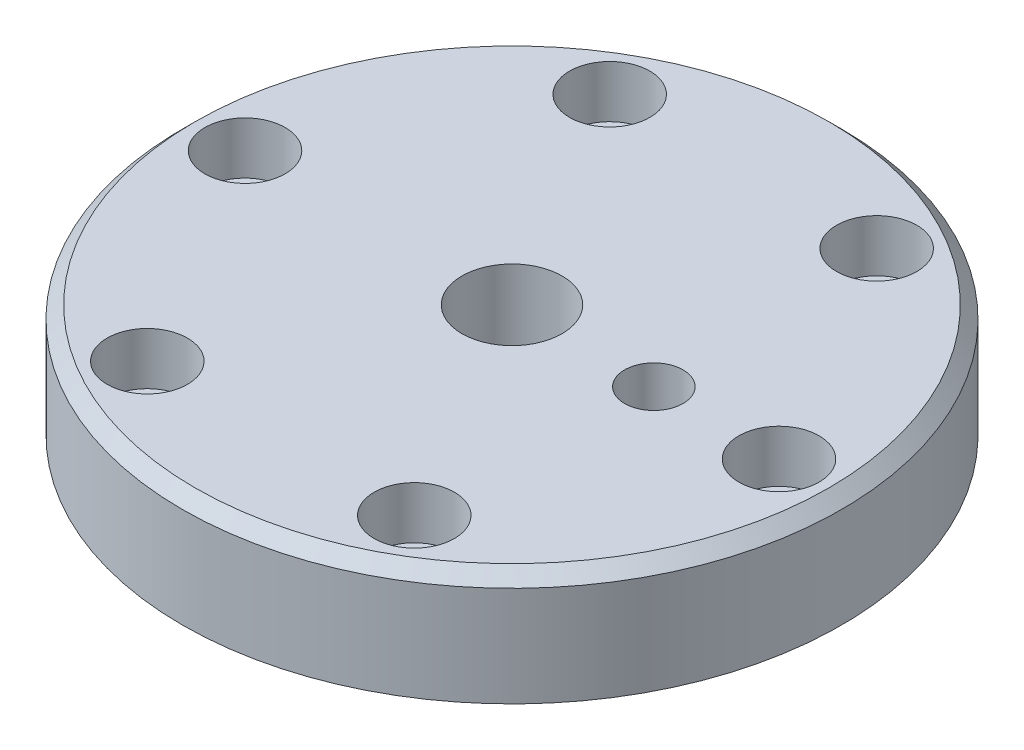
ISO-10303-21;
HEADER;
FILE_DESCRIPTION(('STEP AP214'),'2;1');
FILE_NAME('part.step','',(''),(''),'','','');
FILE_SCHEMA(('AUTOMOTIVE_DESIGN { 1 0 10303 214 1 1 1 1 }'));
ENDSEC;
DATA;
#1=APPLICATION_CONTEXT('core data for automotive mechanical design processes');
#2=APPLICATION_PROTOCOL_DEFINITION('international standard','automotive_design',2000,#1);
#3=PRODUCT_CONTEXT('',#1,'mechanical');
#4=PRODUCT('Part','Part','',(#3));
#5=PRODUCT_RELATED_PRODUCT_CATEGORY('part','',(#4));
#6=PRODUCT_DEFINITION_FORMATION('','',#4);
#7=PRODUCT_DEFINITION_CONTEXT('part definition',#1,'design');
#8=PRODUCT_DEFINITION('design','',#6,#7);
#9=PRODUCT_DEFINITION_SHAPE('','',#8);
#10=(LENGTH_UNIT() NAMED_UNIT(*) SI_UNIT(.MILLI.,.METRE.));
#11=(NAMED_UNIT(*) PLANE_ANGLE_UNIT() SI_UNIT($,.RADIAN.));
#12=(NAMED_UNIT(*) SI_UNIT($,.STERADIAN.) SOLID_ANGLE_UNIT());
#13=UNCERTAINTY_MEASURE_WITH_UNIT(LENGTH_MEASURE(1.E-05),#10,'distance_accuracy_value','');
#14=(GEOMETRIC_REPRESENTATION_CONTEXT(3) GLOBAL_UNCERTAINTY_ASSIGNED_CONTEXT((#13)) GLOBAL_UNIT_ASSIGNED_CONTEXT((#10,
#11,#12)) REPRESENTATION_CONTEXT('',''));
#15=CARTESIAN_POINT('',(0.,0.,0.));
#16=DIRECTION('',(0.,0.,1.));
#17=DIRECTION('',(1.,0.,0.));
#18=AXIS2_PLACEMENT_3D('',#15,#16,#17);
#19=CARTESIAN_POINT('',(0.,0.,0.));
#20=DIRECTION('',(0.,1.,0.));
#21=DIRECTION('',(0.,0.,1.));
#22=AXIS2_PLACEMENT_3D('',#19,#20,#21);
#23=PLANE('',#22);
#24=CARTESIAN_POINT('',(0.,0.,0.));
#25=DIRECTION('',(0.,1.,0.));
#26=DIRECTION('',(0.,0.,1.));
#27=AXIS2_PLACEMENT_3D('',#24,#25,#26);
#28=CIRCLE('',#27,12.);
#29=CARTESIAN_POINT('',(0.,0.,12.));
#30=VERTEX_POINT('',#29);
#31=EDGE_CURVE('E165',#30,#30,#28,.T.);
#32=ORIENTED_EDGE('',*,*,#31,.T.);
#33=EDGE_LOOP('',(#32));
#34=FACE_BOUND('',#33,.T.);
#35=CARTESIAN_POINT('',(0.,0.,0.));
#36=DIRECTION('',(0.,1.,0.));
#37=DIRECTION('',(0.,0.,1.));
#38=AXIS2_PLACEMENT_3D('',#35,#36,#37);
#39=CIRCLE('',#38,22.);
#40=CARTESIAN_POINT('',(0.,0.,22.));
#41=VERTEX_POINT('',#40);
#42=EDGE_CURVE('E333',#41,#41,#39,.T.);
#43=ORIENTED_EDGE('',*,*,#42,.F.);
#44=EDGE_LOOP('',(#43));
#45=FACE_BOUND('',#44,.T.);
#46=ADVANCED_FACE('F39',(#34,#45),#23,.F.);
#47=CARTESIAN_POINT('',(0.,27.,0.));
#48=DIRECTION('',(0.,1.,0.));
#49=DIRECTION('',(0.,0.,1.));
#50=AXIS2_PLACEMENT_3D('',#47,#48,#49);
#51=PLANE('',#50);
#52=CARTESIAN_POINT('',(0.,27.,0.));
#53=DIRECTION('',(0.,1.,0.));
#54=DIRECTION('',(0.,0.,1.));
#55=AXIS2_PLACEMENT_3D('',#52,#53,#54);
#56=CIRCLE('',#55,76.);
#57=CARTESIAN_POINT('',(0.,27.,76.));
#58=VERTEX_POINT('',#57);
#59=EDGE_CURVE('E47',#58,#58,#56,.T.);
#60=ORIENTED_EDGE('',*,*,#59,.T.);
#61=EDGE_LOOP('',(#60));
#62=FACE_BOUND('',#61,.T.);
#63=CARTESIAN_POINT('',(34.,27.,0.));
#64=DIRECTION('',(0.,1.,0.));
#65=DIRECTION('',(0.,0.,1.));
#66=AXIS2_PLACEMENT_3D('',#63,#64,#65);
#67=CIRCLE('',#66,6.99999999999999);
#68=CARTESIAN_POINT('',(34.,27.,6.99999999999999));
#69=VERTEX_POINT('',#68);
#70=EDGE_CURVE('E62',#69,#69,#67,.T.);
#71=ORIENTED_EDGE('',*,*,#70,.F.);
#72=EDGE_LOOP('',(#71));
#73=FACE_BOUND('',#72,.T.);
#74=CARTESIAN_POINT('',(32.,27.,-55.4256258422041));
#75=DIRECTION('',(0.,1.,0.));
#76=DIRECTION('',(0.,0.,1.));
#77=AXIS2_PLACEMENT_3D('',#74,#75,#76);
#78=CIRCLE('',#77,9.625);
#79=CARTESIAN_POINT('',(32.,27.,-45.8006258422041));
#80=VERTEX_POINT('',#79);
#81=EDGE_CURVE('E61',#80,#80,#78,.T.);
#82=ORIENTED_EDGE('',*,*,#81,.F.);
#83=EDGE_LOOP('',(#82));
#84=FACE_BOUND('',#83,.T.);
#85=CARTESIAN_POINT('',(64.0000000000015,27.,-8.71257838218611E-13));
#86=DIRECTION('',(0.,1.,0.));
#87=DIRECTION('',(0.,0.,1.));
#88=AXIS2_PLACEMENT_3D('',#85,#86,#87);
#89=CIRCLE('',#88,9.62499999999999);
#90=CARTESIAN_POINT('',(64.0000000000015,27.,9.62499999999912));
#91=VERTEX_POINT('',#90);
#92=EDGE_CURVE('E85',#91,#91,#89,.T.);
#93=ORIENTED_EDGE('',*,*,#92,.F.);
#94=EDGE_LOOP('',(#93));
#95=FACE_BOUND('',#94,.T.);
#96=CARTESIAN_POINT('',(32.000000000003,27.,55.4256258422041));
#97=DIRECTION('',(0.,1.,0.));
#98=DIRECTION('',(0.,0.,1.));
#99=AXIS2_PLACEMENT_3D('',#96,#97,#98);
#100=CIRCLE('',#99,9.625);
#101=CARTESIAN_POINT('',(32.000000000003,27.,65.0506258422041));
#102=VERTEX_POINT('',#101);
#103=EDGE_CURVE('E101',#102,#102,#100,.T.);
#104=ORIENTED_EDGE('',*,*,#103,.F.);
#105=EDGE_LOOP('',(#104));
#106=FACE_BOUND('',#105,.T.);
#107=CARTESIAN_POINT('',(-31.999999999997,27.,55.4256258422058));
#108=DIRECTION('',(0.,1.,0.));
#109=DIRECTION('',(0.,0.,1.));
#110=AXIS2_PLACEMENT_3D('',#107,#108,#109);
#111=CIRCLE('',#110,9.625);
#112=CARTESIAN_POINT('',(-31.999999999997,27.,65.0506258422058));
#113=VERTEX_POINT('',#112);
#114=EDGE_CURVE('E117',#113,#113,#111,.T.);
#115=ORIENTED_EDGE('',*,*,#114,.F.);
#116=EDGE_LOOP('',(#115));
#117=FACE_BOUND('',#116,.T.);
#118=CARTESIAN_POINT('',(-63.9999999999985,27.,2.62679799590714E-12));
#119=DIRECTION('',(0.,1.,0.));
#120=DIRECTION('',(0.,0.,1.));
#121=AXIS2_PLACEMENT_3D('',#118,#119,#120);
#122=CIRCLE('',#121,9.625);
#123=CARTESIAN_POINT('',(-63.9999999999985,27.,9.62500000000263));
#124=VERTEX_POINT('',#123);
#125=EDGE_CURVE('E133',#124,#124,#122,.T.);
#126=ORIENTED_EDGE('',*,*,#125,.F.);
#127=EDGE_LOOP('',(#126));
#128=FACE_BOUND('',#127,.T.);
#129=CARTESIAN_POINT('',(-32.,27.,-55.4256258422024));
#130=DIRECTION('',(0.,1.,0.));
#131=DIRECTION('',(0.,0.,1.));
#132=AXIS2_PLACEMENT_3D('',#129,#130,#131);
#133=CIRCLE('',#132,9.625);
#134=CARTESIAN_POINT('',(-32.,27.,-45.8006258422024));
#135=VERTEX_POINT('',#134);
#136=EDGE_CURVE('E149',#135,#135,#133,.T.);
#137=ORIENTED_EDGE('',*,*,#136,.F.);
#138=EDGE_LOOP('',(#137));
#139=FACE_BOUND('',#138,.T.);
#140=CARTESIAN_POINT('',(0.,27.,0.));
#141=DIRECTION('',(0.,1.,0.));
#142=DIRECTION('',(0.,0.,1.));
#143=AXIS2_PLACEMENT_3D('',#140,#141,#142);
#144=CIRCLE('',#143,12.);
#145=CARTESIAN_POINT('',(0.,27.,12.));
#146=VERTEX_POINT('',#145);
#147=EDGE_CURVE('E166',#146,#146,#144,.T.);
#148=ORIENTED_EDGE('',*,*,#147,.F.);
#149=EDGE_LOOP('',(#148));
#150=FACE_BOUND('',#149,.T.);
#151=ADVANCED_FACE('F180',(#62,#73,#84,#95,#106,#117,#128,#139,#150),#51,.T.);
#152=CARTESIAN_POINT('',(0.,0.,0.));
#153=DIRECTION('',(0.,1.,0.));
#154=DIRECTION('',(0.,0.,1.));
#155=AXIS2_PLACEMENT_3D('',#152,#153,#154);
#156=CIRCLE('',#155,33.);
#157=CARTESIAN_POINT('',(0.,0.,33.));
#158=VERTEX_POINT('',#157);
#159=EDGE_CURVE('E213',#158,#158,#156,.T.);
#160=ORIENTED_EDGE('',*,*,#159,.T.);
#161=EDGE_LOOP('',(#160));
#162=FACE_BOUND('',#161,.T.);
#163=CARTESIAN_POINT('',(32.,0.,-55.4256258422041));
#164=DIRECTION('',(0.,1.,0.));
#165=DIRECTION('',(0.,0.,1.));
#166=AXIS2_PLACEMENT_3D('',#163,#164,#165);
#167=CIRCLE('',#166,6.24999999999999);
#168=CARTESIAN_POINT('',(32.,0.,-49.1756258422041));
#169=VERTEX_POINT('',#168);
#170=EDGE_CURVE('E81',#169,#169,#167,.T.);
#171=ORIENTED_EDGE('',*,*,#170,.T.);
#172=EDGE_LOOP('',(#171));
#173=FACE_BOUND('',#172,.T.);
#174=CARTESIAN_POINT('',(64.0000000000015,0.,-8.71257838218611E-13));
#175=DIRECTION('',(0.,1.,0.));
#176=DIRECTION('',(0.,0.,1.));
#177=AXIS2_PLACEMENT_3D('',#174,#175,#176);
#178=CIRCLE('',#177,6.24999999999999);
#179=CARTESIAN_POINT('',(64.0000000000015,0.,6.24999999999912));
#180=VERTEX_POINT('',#179);
#181=EDGE_CURVE('E97',#180,#180,#178,.T.);
#182=ORIENTED_EDGE('',*,*,#181,.T.);
#183=EDGE_LOOP('',(#182));
#184=FACE_BOUND('',#183,.T.);
#185=CARTESIAN_POINT('',(32.000000000003,0.,55.4256258422041));
#186=DIRECTION('',(0.,1.,0.));
#187=DIRECTION('',(0.,0.,1.));
#188=AXIS2_PLACEMENT_3D('',#185,#186,#187);
#189=CIRCLE('',#188,6.24999999999999);
#190=CARTESIAN_POINT('',(32.000000000003,0.,61.6756258422041));
#191=VERTEX_POINT('',#190);
#192=EDGE_CURVE('E113',#191,#191,#189,.T.);
#193=ORIENTED_EDGE('',*,*,#192,.T.);
#194=EDGE_LOOP('',(#193));
#195=FACE_BOUND('',#194,.T.);
#196=CARTESIAN_POINT('',(-31.999999999997,0.,55.4256258422058));
#197=DIRECTION('',(0.,1.,0.));
#198=DIRECTION('',(0.,0.,1.));
#199=AXIS2_PLACEMENT_3D('',#196,#197,#198);
#200=CIRCLE('',#199,6.24999999999999);
#201=CARTESIAN_POINT('',(-31.999999999997,0.,61.6756258422058));
#202=VERTEX_POINT('',#201);
#203=EDGE_CURVE('E129',#202,#202,#200,.T.);
#204=ORIENTED_EDGE('',*,*,#203,.T.);
#205=EDGE_LOOP('',(#204));
#206=FACE_BOUND('',#205,.T.);
#207=CARTESIAN_POINT('',(-63.9999999999985,0.,2.62679799590714E-12));
#208=DIRECTION('',(0.,1.,0.));
#209=DIRECTION('',(0.,0.,1.));
#210=AXIS2_PLACEMENT_3D('',#207,#208,#209);
#211=CIRCLE('',#210,6.24999999999999);
#212=CARTESIAN_POINT('',(-63.9999999999985,0.,6.25000000000262));
#213=VERTEX_POINT('',#212);
#214=EDGE_CURVE('E145',#213,#213,#211,.T.);
#215=ORIENTED_EDGE('',*,*,#214,.T.);
#216=EDGE_LOOP('',(#215));
#217=FACE_BOUND('',#216,.T.);
#218=CARTESIAN_POINT('',(-32.,0.,-55.4256258422024));
#219=DIRECTION('',(0.,1.,0.));
#220=DIRECTION('',(0.,0.,1.));
#221=AXIS2_PLACEMENT_3D('',#218,#219,#220);
#222=CIRCLE('',#221,6.24999999999999);
#223=CARTESIAN_POINT('',(-32.,0.,-49.1756258422024));
#224=VERTEX_POINT('',#223);
#225=EDGE_CURVE('E161',#224,#224,#222,.T.);
#226=ORIENTED_EDGE('',*,*,#225,.T.);
#227=EDGE_LOOP('',(#226));
#228=FACE_BOUND('',#227,.T.);
#229=CARTESIAN_POINT('',(0.,0.,0.));
#230=DIRECTION('',(0.,1.,0.));
#231=DIRECTION('',(0.,0.,1.));
#232=AXIS2_PLACEMENT_3D('',#229,#230,#231);
#233=CIRCLE('',#232,79.);
#234=CARTESIAN_POINT('',(0.,0.,79.));
#235=VERTEX_POINT('',#234);
#236=EDGE_CURVE('E170',#235,#235,#233,.T.);
#237=ORIENTED_EDGE('',*,*,#236,.F.);
#238=EDGE_LOOP('',(#237));
#239=FACE_BOUND('',#238,.T.);
#240=ADVANCED_FACE('F196',(#162,#173,#184,#195,#206,#217,#228,#239),#23,.F.);
#241=CARTESIAN_POINT('',(0.,27.,0.));
#242=DIRECTION('',(0.,-1.,0.));
#243=DIRECTION('',(0.,0.,-1.));
#244=AXIS2_PLACEMENT_3D('',#241,#242,#243);
#245=CYLINDRICAL_SURFACE('',#244,79.);
#246=CARTESIAN_POINT('',(0.,24.,0.));
#247=DIRECTION('',(0.,1.,0.));
#248=DIRECTION('',(0.,0.,1.));
#249=AXIS2_PLACEMENT_3D('',#246,#247,#248);
#250=CIRCLE('',#249,79.);
#251=CARTESIAN_POINT('',(0.,24.,79.));
#252=VERTEX_POINT('',#251);
#253=EDGE_CURVE('E11',#252,#252,#250,.F.);
#254=ORIENTED_EDGE('',*,*,#253,.T.);
#255=EDGE_LOOP('',(#254));
#256=FACE_BOUND('',#255,.T.);
#257=ORIENTED_EDGE('',*,*,#236,.T.);
#258=EDGE_LOOP('',(#257));
#259=FACE_BOUND('',#258,.T.);
#260=ADVANCED_FACE('F203',(#256,#259),#245,.T.);
#261=CARTESIAN_POINT('',(0.,27.,0.));
#262=DIRECTION('',(0.,-1.,0.));
#263=DIRECTION('',(0.,0.,-1.));
#264=AXIS2_PLACEMENT_3D('',#261,#262,#263);
#265=CYLINDRICAL_SURFACE('',#264,12.);
#266=ORIENTED_EDGE('',*,*,#147,.T.);
#267=EDGE_LOOP('',(#266));
#268=FACE_BOUND('',#267,.T.);
#269=ORIENTED_EDGE('',*,*,#31,.F.);
#270=EDGE_LOOP('',(#269));
#271=FACE_BOUND('',#270,.T.);
#272=ADVANCED_FACE('F208',(#268,#271),#265,.F.);
#273=CARTESIAN_POINT('',(-32.,27.,-55.4256258422024));
#274=DIRECTION('',(0.,1.,0.));
#275=DIRECTION('',(0.,0.,1.));
#276=AXIS2_PLACEMENT_3D('',#273,#274,#275);
#277=CYLINDRICAL_SURFACE('',#276,6.25);
#278=ORIENTED_EDGE('',*,*,#225,.F.);
#279=EDGE_LOOP('',(#278));
#280=FACE_BOUND('',#279,.T.);
#281=CARTESIAN_POINT('',(-32.,14.5,-55.4256258422024));
#282=DIRECTION('',(0.,1.,0.));
#283=DIRECTION('',(0.,0.,1.));
#284=AXIS2_PLACEMENT_3D('',#281,#282,#283);
#285=CIRCLE('',#284,6.25);
#286=CARTESIAN_POINT('',(-32.,14.5,-49.1756258422024));
#287=VERTEX_POINT('',#286);
#288=EDGE_CURVE('E157',#287,#287,#285,.T.);
#289=ORIENTED_EDGE('',*,*,#288,.T.);
#290=EDGE_LOOP('',(#289));
#291=FACE_BOUND('',#290,.T.);
#292=ADVANCED_FACE('F229',(#280,#291),#277,.F.);
#293=CARTESIAN_POINT('',(-25.75,14.5,-55.4256258422024));
#294=DIRECTION('',(0.,-1.,0.));
#295=DIRECTION('',(0.,0.,-1.));
#296=AXIS2_PLACEMENT_3D('',#293,#294,#295);
#297=PLANE('',#296);
#298=ORIENTED_EDGE('',*,*,#288,.F.);
#299=EDGE_LOOP('',(#298));
#300=FACE_BOUND('',#299,.T.);
#301=CARTESIAN_POINT('',(-32.,14.5,-55.4256258422024));
#302=DIRECTION('',(0.,1.,0.));
#303=DIRECTION('',(0.,0.,1.));
#304=AXIS2_PLACEMENT_3D('',#301,#302,#303);
#305=CIRCLE('',#304,9.625);
#306=CARTESIAN_POINT('',(-32.,14.5,-45.8006258422024));
#307=VERTEX_POINT('',#306);
#308=EDGE_CURVE('E153',#307,#307,#305,.T.);
#309=ORIENTED_EDGE('',*,*,#308,.T.);
#310=EDGE_LOOP('',(#309));
#311=FACE_BOUND('',#310,.T.);
#312=ADVANCED_FACE('F232',(#300,#311),#297,.F.);
#313=CARTESIAN_POINT('',(-32.,27.,-55.4256258422024));
#314=DIRECTION('',(0.,1.,0.));
#315=DIRECTION('',(0.,0.,1.));
#316=AXIS2_PLACEMENT_3D('',#313,#314,#315);
#317=CYLINDRICAL_SURFACE('',#316,9.625);
#318=ORIENTED_EDGE('',*,*,#308,.F.);
#319=EDGE_LOOP('',(#318));
#320=FACE_BOUND('',#319,.T.);
#321=ORIENTED_EDGE('',*,*,#136,.T.);
#322=EDGE_LOOP('',(#321));
#323=FACE_BOUND('',#322,.T.);
#324=ADVANCED_FACE('F238',(#320,#323),#317,.F.);
#325=CARTESIAN_POINT('',(-63.9999999999985,27.,2.62679799590714E-12));
#326=DIRECTION('',(0.,1.,0.));
#327=DIRECTION('',(0.,0.,1.));
#328=AXIS2_PLACEMENT_3D('',#325,#326,#327);
#329=CYLINDRICAL_SURFACE('',#328,6.25);
#330=ORIENTED_EDGE('',*,*,#214,.F.);
#331=EDGE_LOOP('',(#330));
#332=FACE_BOUND('',#331,.T.);
#333=CARTESIAN_POINT('',(-63.9999999999985,14.5,2.62679799590714E-12));
#334=DIRECTION('',(0.,1.,0.));
#335=DIRECTION('',(0.,0.,1.));
#336=AXIS2_PLACEMENT_3D('',#333,#334,#335);
#337=CIRCLE('',#336,6.25);
#338=CARTESIAN_POINT('',(-63.9999999999985,14.5,6.25000000000262));
#339=VERTEX_POINT('',#338);
#340=EDGE_CURVE('E141',#339,#339,#337,.T.);
#341=ORIENTED_EDGE('',*,*,#340,.T.);
#342=EDGE_LOOP('',(#341));
#343=FACE_BOUND('',#342,.T.);
#344=ADVANCED_FACE('F244',(#332,#343),#329,.F.);
#345=CARTESIAN_POINT('',(-57.7499999999985,14.5,2.62679799590714E-12));
#346=DIRECTION('',(0.,-1.,0.));
#347=DIRECTION('',(0.,0.,-1.));
#348=AXIS2_PLACEMENT_3D('',#345,#346,#347);
#349=PLANE('',#348);
#350=ORIENTED_EDGE('',*,*,#340,.F.);
#351=EDGE_LOOP('',(#350));
#352=FACE_BOUND('',#351,.T.);
#353=CARTESIAN_POINT('',(-63.9999999999985,14.5,2.62679799590714E-12));
#354=DIRECTION('',(0.,1.,0.));
#355=DIRECTION('',(0.,0.,1.));
#356=AXIS2_PLACEMENT_3D('',#353,#354,#355);
#357=CIRCLE('',#356,9.62499999999999);
#358=CARTESIAN_POINT('',(-63.9999999999985,14.5,9.62500000000262));
#359=VERTEX_POINT('',#358);
#360=EDGE_CURVE('E137',#359,#359,#357,.T.);
#361=ORIENTED_EDGE('',*,*,#360,.T.);
#362=EDGE_LOOP('',(#361));
#363=FACE_BOUND('',#362,.T.);
#364=ADVANCED_FACE('F260',(#352,#363),#349,.F.);
#365=CARTESIAN_POINT('',(-63.9999999999985,27.,2.62679799590714E-12));
#366=DIRECTION('',(0.,1.,0.));
#367=DIRECTION('',(0.,0.,1.));
#368=AXIS2_PLACEMENT_3D('',#365,#366,#367);
#369=CYLINDRICAL_SURFACE('',#368,9.625);
#370=ORIENTED_EDGE('',*,*,#360,.F.);
#371=EDGE_LOOP('',(#370));
#372=FACE_BOUND('',#371,.T.);
#373=ORIENTED_EDGE('',*,*,#125,.T.);
#374=EDGE_LOOP('',(#373));
#375=FACE_BOUND('',#374,.T.);
#376=ADVANCED_FACE('F264',(#372,#375),#369,.F.);
#377=CARTESIAN_POINT('',(-31.999999999997,27.,55.4256258422058));
#378=DIRECTION('',(0.,1.,0.));
#379=DIRECTION('',(0.,0.,1.));
#380=AXIS2_PLACEMENT_3D('',#377,#378,#379);
#381=CYLINDRICAL_SURFACE('',#380,6.25);
#382=ORIENTED_EDGE('',*,*,#203,.F.);
#383=EDGE_LOOP('',(#382));
#384=FACE_BOUND('',#383,.T.);
#385=CARTESIAN_POINT('',(-31.999999999997,14.5,55.4256258422058));
#386=DIRECTION('',(0.,1.,0.));
#387=DIRECTION('',(0.,0.,1.));
#388=AXIS2_PLACEMENT_3D('',#385,#386,#387);
#389=CIRCLE('',#388,6.25);
#390=CARTESIAN_POINT('',(-31.999999999997,14.5,61.6756258422058));
#391=VERTEX_POINT('',#390);
#392=EDGE_CURVE('E125',#391,#391,#389,.T.);
#393=ORIENTED_EDGE('',*,*,#392,.T.);
#394=EDGE_LOOP('',(#393));
#395=FACE_BOUND('',#394,.T.);
#396=ADVANCED_FACE('F268',(#384,#395),#381,.F.);
#397=CARTESIAN_POINT('',(-25.749999999997,14.5,55.4256258422058));
#398=DIRECTION('',(0.,-1.,0.));
#399=DIRECTION('',(0.,0.,-1.));
#400=AXIS2_PLACEMENT_3D('',#397,#398,#399);
#401=PLANE('',#400);
#402=ORIENTED_EDGE('',*,*,#392,.F.);
#403=EDGE_LOOP('',(#402));
#404=FACE_BOUND('',#403,.T.);
#405=CARTESIAN_POINT('',(-31.999999999997,14.5,55.4256258422058));
#406=DIRECTION('',(0.,1.,0.));
#407=DIRECTION('',(0.,0.,1.));
#408=AXIS2_PLACEMENT_3D('',#405,#406,#407);
#409=CIRCLE('',#408,9.625);
#410=CARTESIAN_POINT('',(-31.999999999997,14.5,65.0506258422058));
#411=VERTEX_POINT('',#410);
#412=EDGE_CURVE('E121',#411,#411,#409,.T.);
#413=ORIENTED_EDGE('',*,*,#412,.T.);
#414=EDGE_LOOP('',(#413));
#415=FACE_BOUND('',#414,.T.);
#416=ADVANCED_FACE('F272',(#404,#415),#401,.F.);
#417=CARTESIAN_POINT('',(-31.999999999997,27.,55.4256258422058));
#418=DIRECTION('',(0.,1.,0.));
#419=DIRECTION('',(0.,0.,1.));
#420=AXIS2_PLACEMENT_3D('',#417,#418,#419);
#421=CYLINDRICAL_SURFACE('',#420,9.625);
#422=ORIENTED_EDGE('',*,*,#412,.F.);
#423=EDGE_LOOP('',(#422));
#424=FACE_BOUND('',#423,.T.);
#425=ORIENTED_EDGE('',*,*,#114,.T.);
#426=EDGE_LOOP('',(#425));
#427=FACE_BOUND('',#426,.T.);
#428=ADVANCED_FACE('F276',(#424,#427),#421,.F.);
#429=CARTESIAN_POINT('',(32.000000000003,27.,55.4256258422041));
#430=DIRECTION('',(0.,1.,0.));
#431=DIRECTION('',(0.,0.,1.));
#432=AXIS2_PLACEMENT_3D('',#429,#430,#431);
#433=CYLINDRICAL_SURFACE('',#432,6.25);
#434=ORIENTED_EDGE('',*,*,#192,.F.);
#435=EDGE_LOOP('',(#434));
#436=FACE_BOUND('',#435,.T.);
#437=CARTESIAN_POINT('',(32.000000000003,14.5,55.4256258422041));
#438=DIRECTION('',(0.,1.,0.));
#439=DIRECTION('',(0.,0.,1.));
#440=AXIS2_PLACEMENT_3D('',#437,#438,#439);
#441=CIRCLE('',#440,6.25);
#442=CARTESIAN_POINT('',(32.000000000003,14.5,61.6756258422041));
#443=VERTEX_POINT('',#442);
#444=EDGE_CURVE('E109',#443,#443,#441,.T.);
#445=ORIENTED_EDGE('',*,*,#444,.T.);
#446=EDGE_LOOP('',(#445));
#447=FACE_BOUND('',#446,.T.);
#448=ADVANCED_FACE('F280',(#436,#447),#433,.F.);
#449=CARTESIAN_POINT('',(38.250000000003,14.5,55.4256258422041));
#450=DIRECTION('',(0.,-1.,0.));
#451=DIRECTION('',(0.,0.,-1.));
#452=AXIS2_PLACEMENT_3D('',#449,#450,#451);
#453=PLANE('',#452);
#454=ORIENTED_EDGE('',*,*,#444,.F.);
#455=EDGE_LOOP('',(#454));
#456=FACE_BOUND('',#455,.T.);
#457=CARTESIAN_POINT('',(32.000000000003,14.5,55.4256258422041));
#458=DIRECTION('',(0.,1.,0.));
#459=DIRECTION('',(0.,0.,1.));
#460=AXIS2_PLACEMENT_3D('',#457,#458,#459);
#461=CIRCLE('',#460,9.62499999999999);
#462=CARTESIAN_POINT('',(32.000000000003,14.5,65.0506258422041));
#463=VERTEX_POINT('',#462);
#464=EDGE_CURVE('E105',#463,#463,#461,.T.);
#465=ORIENTED_EDGE('',*,*,#464,.T.);
#466=EDGE_LOOP('',(#465));
#467=FACE_BOUND('',#466,.T.);
#468=ADVANCED_FACE('F284',(#456,#467),#453,.F.);
#469=CARTESIAN_POINT('',(32.000000000003,27.,55.4256258422041));
#470=DIRECTION('',(0.,1.,0.));
#471=DIRECTION('',(0.,0.,1.));
#472=AXIS2_PLACEMENT_3D('',#469,#470,#471);
#473=CYLINDRICAL_SURFACE('',#472,9.625);
#474=ORIENTED_EDGE('',*,*,#464,.F.);
#475=EDGE_LOOP('',(#474));
#476=FACE_BOUND('',#475,.T.);
#477=ORIENTED_EDGE('',*,*,#103,.T.);
#478=EDGE_LOOP('',(#477));
#479=FACE_BOUND('',#478,.T.);
#480=ADVANCED_FACE('F288',(#476,#479),#473,.F.);
#481=CARTESIAN_POINT('',(64.0000000000015,27.,-8.71257838218611E-13));
#482=DIRECTION('',(0.,1.,0.));
#483=DIRECTION('',(0.,0.,1.));
#484=AXIS2_PLACEMENT_3D('',#481,#482,#483);
#485=CYLINDRICAL_SURFACE('',#484,6.24999999999999);
#486=ORIENTED_EDGE('',*,*,#181,.F.);
#487=EDGE_LOOP('',(#486));
#488=FACE_BOUND('',#487,.T.);
#489=CARTESIAN_POINT('',(64.0000000000015,14.5,-8.71257838218611E-13));
#490=DIRECTION('',(0.,1.,0.));
#491=DIRECTION('',(0.,0.,1.));
#492=AXIS2_PLACEMENT_3D('',#489,#490,#491);
#493=CIRCLE('',#492,6.24999999999999);
#494=CARTESIAN_POINT('',(64.0000000000015,14.5,6.24999999999912));
#495=VERTEX_POINT('',#494);
#496=EDGE_CURVE('E93',#495,#495,#493,.T.);
#497=ORIENTED_EDGE('',*,*,#496,.T.);
#498=EDGE_LOOP('',(#497));
#499=FACE_BOUND('',#498,.T.);
#500=ADVANCED_FACE('F292',(#488,#499),#485,.F.);
#501=CARTESIAN_POINT('',(70.2500000000015,14.5,-8.71257838218611E-13));
#502=DIRECTION('',(0.,-1.,0.));
#503=DIRECTION('',(0.,0.,-1.));
#504=AXIS2_PLACEMENT_3D('',#501,#502,#503);
#505=PLANE('',#504);
#506=ORIENTED_EDGE('',*,*,#496,.F.);
#507=EDGE_LOOP('',(#506));
#508=FACE_BOUND('',#507,.T.);
#509=CARTESIAN_POINT('',(64.0000000000015,14.5,-8.71257838218611E-13));
#510=DIRECTION('',(0.,1.,0.));
#511=DIRECTION('',(0.,0.,1.));
#512=AXIS2_PLACEMENT_3D('',#509,#510,#511);
#513=CIRCLE('',#512,9.62499999999999);
#514=CARTESIAN_POINT('',(64.0000000000015,14.5,9.62499999999912));
#515=VERTEX_POINT('',#514);
#516=EDGE_CURVE('E89',#515,#515,#513,.T.);
#517=ORIENTED_EDGE('',*,*,#516,.T.);
#518=EDGE_LOOP('',(#517));
#519=FACE_BOUND('',#518,.T.);
#520=ADVANCED_FACE('F296',(#508,#519),#505,.F.);
#521=CARTESIAN_POINT('',(64.0000000000015,27.,-8.71257838218611E-13));
#522=DIRECTION('',(0.,1.,0.));
#523=DIRECTION('',(0.,0.,1.));
#524=AXIS2_PLACEMENT_3D('',#521,#522,#523);
#525=CYLINDRICAL_SURFACE('',#524,9.62499999999999);
#526=ORIENTED_EDGE('',*,*,#516,.F.);
#527=EDGE_LOOP('',(#526));
#528=FACE_BOUND('',#527,.T.);
#529=ORIENTED_EDGE('',*,*,#92,.T.);
#530=EDGE_LOOP('',(#529));
#531=FACE_BOUND('',#530,.T.);
#532=ADVANCED_FACE('F300',(#528,#531),#525,.F.);
#533=CARTESIAN_POINT('',(32.,27.,-55.4256258422041));
#534=DIRECTION('',(0.,1.,0.));
#535=DIRECTION('',(0.,0.,1.));
#536=AXIS2_PLACEMENT_3D('',#533,#534,#535);
#537=CYLINDRICAL_SURFACE('',#536,6.25);
#538=ORIENTED_EDGE('',*,*,#170,.F.);
#539=EDGE_LOOP('',(#538));
#540=FACE_BOUND('',#539,.T.);
#541=CARTESIAN_POINT('',(32.,14.5,-55.4256258422041));
#542=DIRECTION('',(0.,1.,0.));
#543=DIRECTION('',(0.,0.,1.));
#544=AXIS2_PLACEMENT_3D('',#541,#542,#543);
#545=CIRCLE('',#544,6.25);
#546=CARTESIAN_POINT('',(32.,14.5,-49.1756258422041));
#547=VERTEX_POINT('',#546);
#548=EDGE_CURVE('E77',#547,#547,#545,.T.);
#549=ORIENTED_EDGE('',*,*,#548,.T.);
#550=EDGE_LOOP('',(#549));
#551=FACE_BOUND('',#550,.T.);
#552=ADVANCED_FACE('F304',(#540,#551),#537,.F.);
#553=CARTESIAN_POINT('',(38.25,14.5,-55.4256258422041));
#554=DIRECTION('',(0.,-1.,0.));
#555=DIRECTION('',(0.,0.,-1.));
#556=AXIS2_PLACEMENT_3D('',#553,#554,#555);
#557=PLANE('',#556);
#558=ORIENTED_EDGE('',*,*,#548,.F.);
#559=EDGE_LOOP('',(#558));
#560=FACE_BOUND('',#559,.T.);
#561=CARTESIAN_POINT('',(32.,14.5,-55.4256258422041));
#562=DIRECTION('',(0.,1.,0.));
#563=DIRECTION('',(0.,0.,1.));
#564=AXIS2_PLACEMENT_3D('',#561,#562,#563);
#565=CIRCLE('',#564,9.62499999999999);
#566=CARTESIAN_POINT('',(32.,14.5,-45.8006258422041));
#567=VERTEX_POINT('',#566);
#568=EDGE_CURVE('E67',#567,#567,#565,.T.);
#569=ORIENTED_EDGE('',*,*,#568,.T.);
#570=EDGE_LOOP('',(#569));
#571=FACE_BOUND('',#570,.T.);
#572=ADVANCED_FACE('F308',(#560,#571),#557,.F.);
#573=CARTESIAN_POINT('',(32.,27.,-55.4256258422041));
#574=DIRECTION('',(0.,1.,0.));
#575=DIRECTION('',(0.,0.,1.));
#576=AXIS2_PLACEMENT_3D('',#573,#574,#575);
#577=CYLINDRICAL_SURFACE('',#576,9.625);
#578=ORIENTED_EDGE('',*,*,#568,.F.);
#579=EDGE_LOOP('',(#578));
#580=FACE_BOUND('',#579,.T.);
#581=ORIENTED_EDGE('',*,*,#81,.T.);
#582=EDGE_LOOP('',(#581));
#583=FACE_BOUND('',#582,.T.);
#584=ADVANCED_FACE('F54',(#580,#583),#577,.F.);
#585=CARTESIAN_POINT('',(34.,10.,0.));
#586=DIRECTION('',(0.,1.,0.));
#587=DIRECTION('',(0.,0.,1.));
#588=AXIS2_PLACEMENT_3D('',#585,#586,#587);
#589=CONICAL_SURFACE('',#588,7.,1.02974425867665);
#590=CARTESIAN_POINT('',(34.,5.79397566680707,0.));
#591=VERTEX_POINT('',#590);
#592=VERTEX_LOOP('',#591);
#593=FACE_BOUND('',#592,.T.);
#594=CARTESIAN_POINT('',(34.,10.,0.));
#595=DIRECTION('',(0.,1.,0.));
#596=DIRECTION('',(0.,0.,1.));
#597=AXIS2_PLACEMENT_3D('',#594,#595,#596);
#598=CIRCLE('',#597,7.);
#599=CARTESIAN_POINT('',(34.,10.,7.));
#600=VERTEX_POINT('',#599);
#601=EDGE_CURVE('E58',#600,#600,#598,.T.);
#602=ORIENTED_EDGE('',*,*,#601,.T.);
#603=EDGE_LOOP('',(#602));
#604=FACE_BOUND('',#603,.T.);
#605=ADVANCED_FACE('F50',(#593,#604),#589,.F.);
#606=CARTESIAN_POINT('',(34.,27.,0.));
#607=DIRECTION('',(0.,1.,0.));
#608=DIRECTION('',(0.,0.,1.));
#609=AXIS2_PLACEMENT_3D('',#606,#607,#608);
#610=CYLINDRICAL_SURFACE('',#609,6.99999999999999);
#611=ORIENTED_EDGE('',*,*,#601,.F.);
#612=EDGE_LOOP('',(#611));
#613=FACE_BOUND('',#612,.T.);
#614=ORIENTED_EDGE('',*,*,#70,.T.);
#615=EDGE_LOOP('',(#614));
#616=FACE_BOUND('',#615,.T.);
#617=ADVANCED_FACE('F53',(#613,#616),#610,.F.);
#618=CARTESIAN_POINT('',(0.,6.,0.));
#619=DIRECTION('',(0.,1.,0.));
#620=DIRECTION('',(0.,0.,1.));
#621=AXIS2_PLACEMENT_3D('',#618,#619,#620);
#622=PLANE('',#621);
#623=CARTESIAN_POINT('',(0.,6.,0.));
#624=DIRECTION('',(0.,1.,0.));
#625=DIRECTION('',(0.,0.,1.));
#626=AXIS2_PLACEMENT_3D('',#623,#624,#625);
#627=CIRCLE('',#626,33.);
#628=CARTESIAN_POINT('',(0.,6.,33.));
#629=VERTEX_POINT('',#628);
#630=EDGE_CURVE('E70',#629,#629,#627,.T.);
#631=ORIENTED_EDGE('',*,*,#630,.F.);
#632=EDGE_LOOP('',(#631));
#633=FACE_BOUND('',#632,.T.);
#634=CARTESIAN_POINT('',(0.,6.,0.));
#635=DIRECTION('',(0.,1.,0.));
#636=DIRECTION('',(0.,0.,1.));
#637=AXIS2_PLACEMENT_3D('',#634,#635,#636);
#638=CIRCLE('',#637,22.);
#639=CARTESIAN_POINT('',(0.,6.,22.));
#640=VERTEX_POINT('',#639);
#641=EDGE_CURVE('E331',#640,#640,#638,.T.);
#642=ORIENTED_EDGE('',*,*,#641,.T.);
#643=EDGE_LOOP('',(#642));
#644=FACE_BOUND('',#643,.T.);
#645=ADVANCED_FACE('F318',(#633,#644),#622,.F.);
#646=CARTESIAN_POINT('',(0.,6.,0.));
#647=DIRECTION('',(0.,-1.,0.));
#648=DIRECTION('',(0.,0.,-1.));
#649=AXIS2_PLACEMENT_3D('',#646,#647,#648);
#650=CYLINDRICAL_SURFACE('',#649,33.);
#651=ORIENTED_EDGE('',*,*,#630,.T.);
#652=EDGE_LOOP('',(#651));
#653=FACE_BOUND('',#652,.T.);
#654=ORIENTED_EDGE('',*,*,#159,.F.);
#655=EDGE_LOOP('',(#654));
#656=FACE_BOUND('',#655,.T.);
#657=ADVANCED_FACE('F189',(#653,#656),#650,.F.);
#658=CARTESIAN_POINT('',(0.,6.,0.));
#659=DIRECTION('',(0.,-1.,0.));
#660=DIRECTION('',(0.,0.,-1.));
#661=AXIS2_PLACEMENT_3D('',#658,#659,#660);
#662=CYLINDRICAL_SURFACE('',#661,22.);
#663=ORIENTED_EDGE('',*,*,#641,.F.);
#664=EDGE_LOOP('',(#663));
#665=FACE_BOUND('',#664,.T.);
#666=ORIENTED_EDGE('',*,*,#42,.T.);
#667=EDGE_LOOP('',(#666));
#668=FACE_BOUND('',#667,.T.);
#669=ADVANCED_FACE('F184',(#665,#668),#662,.T.);
#670=CARTESIAN_POINT('',(0.,27.,0.));
#671=DIRECTION('',(0.,-1.,0.));
#672=DIRECTION('',(0.,0.,-1.));
#673=AXIS2_PLACEMENT_3D('',#670,#671,#672);
#674=CONICAL_SURFACE('',#673,76.,0.785398163397444);
#675=ORIENTED_EDGE('',*,*,#253,.F.);
#676=EDGE_LOOP('',(#675));
#677=FACE_BOUND('',#676,.T.);
#678=ORIENTED_EDGE('',*,*,#59,.F.);
#679=EDGE_LOOP('',(#678));
#680=FACE_BOUND('',#679,.T.);
#681=ADVANCED_FACE('F41',(#677,#680),#674,.T.);
#682=CLOSED_SHELL('',(#46,#151,#240,#260,#272,#292,#312,#324,#344,#364,#376,#396,#416,#428,#448,
#468,#480,#500,#520,#532,#552,#572,#584,#605,#617,#645,#657,#669,#681));
#683=MANIFOLD_SOLID_BREP('B2',#682);
#684=ADVANCED_BREP_SHAPE_REPRESENTATION('',(#18,#683),#14);
#685=SHAPE_DEFINITION_REPRESENTATION(#9,#684);
ENDSEC;
END-ISO-10303-21;
